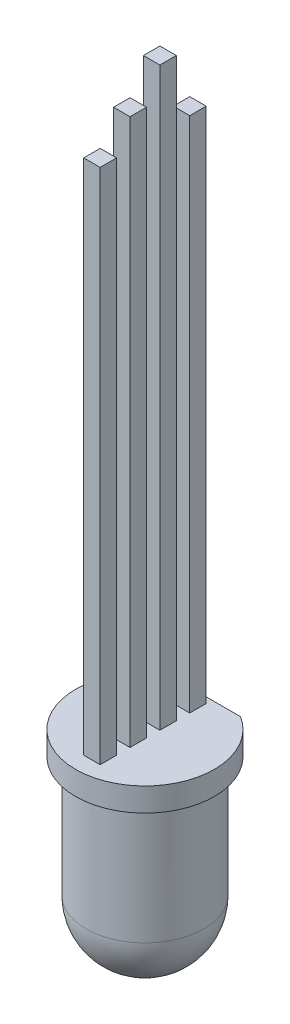
ISO-10303-21;
HEADER;
FILE_DESCRIPTION(('STEP AP214'),'2;1');
FILE_NAME('part.step','',(''),(''),'','','');
FILE_SCHEMA(('AUTOMOTIVE_DESIGN { 1 0 10303 214 1 1 1 1 }'));
ENDSEC;
DATA;
#1=APPLICATION_CONTEXT('core data for automotive mechanical design processes');
#2=APPLICATION_PROTOCOL_DEFINITION('international standard','automotive_design',2000,#1);
#3=PRODUCT_CONTEXT('',#1,'mechanical');
#4=PRODUCT('Part','Part','',(#3));
#5=PRODUCT_RELATED_PRODUCT_CATEGORY('part','',(#4));
#6=PRODUCT_DEFINITION_FORMATION('','',#4);
#7=PRODUCT_DEFINITION_CONTEXT('part definition',#1,'design');
#8=PRODUCT_DEFINITION('design','',#6,#7);
#9=PRODUCT_DEFINITION_SHAPE('','',#8);
#10=(LENGTH_UNIT() NAMED_UNIT(*) SI_UNIT(.MILLI.,.METRE.));
#11=(NAMED_UNIT(*) PLANE_ANGLE_UNIT() SI_UNIT($,.RADIAN.));
#12=(NAMED_UNIT(*) SI_UNIT($,.STERADIAN.) SOLID_ANGLE_UNIT());
#13=UNCERTAINTY_MEASURE_WITH_UNIT(LENGTH_MEASURE(1.E-05),#10,'distance_accuracy_value','');
#14=(GEOMETRIC_REPRESENTATION_CONTEXT(3) GLOBAL_UNCERTAINTY_ASSIGNED_CONTEXT((#13)) GLOBAL_UNIT_ASSIGNED_CONTEXT((#10,
#11,#12)) REPRESENTATION_CONTEXT('',''));
#15=CARTESIAN_POINT('',(0.,0.,0.));
#16=DIRECTION('',(0.,0.,1.));
#17=DIRECTION('',(1.,0.,0.));
#18=AXIS2_PLACEMENT_3D('',#15,#16,#17);
#19=CARTESIAN_POINT('',(2.95000000000001,8.6,0.));
#20=DIRECTION('',(0.,1.,0.));
#21=DIRECTION('',(-1.,0.,0.));
#22=AXIS2_PLACEMENT_3D('',#19,#20,#21);
#23=PLANE('',#22);
#24=DIRECTION('',(1.,0.,0.));
#25=VECTOR('',#24,1.);
#26=CARTESIAN_POINT('',(0.350000000000002,8.6,2.255));
#27=LINE('',#26,#25);
#28=CARTESIAN_POINT('',(-0.349999999999998,8.6,2.255));
#29=VERTEX_POINT('',#28);
#30=CARTESIAN_POINT('',(0.350000000000002,8.6,2.255));
#31=VERTEX_POINT('',#30);
#32=EDGE_CURVE('E261',#29,#31,#27,.T.);
#33=ORIENTED_EDGE('',*,*,#32,.F.);
#34=DIRECTION('',(0.,0.,1.));
#35=VECTOR('',#34,1.);
#36=CARTESIAN_POINT('',(-0.349999999999998,8.6,2.255));
#37=LINE('',#36,#35);
#38=CARTESIAN_POINT('',(-0.349999999999998,8.6,1.555));
#39=VERTEX_POINT('',#38);
#40=EDGE_CURVE('E258',#39,#29,#37,.T.);
#41=ORIENTED_EDGE('',*,*,#40,.F.);
#42=DIRECTION('',(-1.,0.,0.));
#43=VECTOR('',#42,1.);
#44=CARTESIAN_POINT('',(-0.349999999999998,8.6,1.555));
#45=LINE('',#44,#43);
#46=CARTESIAN_POINT('',(0.350000000000017,8.6,1.555));
#47=VERTEX_POINT('',#46);
#48=EDGE_CURVE('E267',#47,#39,#45,.T.);
#49=ORIENTED_EDGE('',*,*,#48,.F.);
#50=DIRECTION('',(0.,0.,-1.));
#51=VECTOR('',#50,1.);
#52=CARTESIAN_POINT('',(0.350000000000002,8.6,1.555));
#53=LINE('',#52,#51);
#54=EDGE_CURVE('E264',#31,#47,#53,.T.);
#55=ORIENTED_EDGE('',*,*,#54,.F.);
#56=EDGE_LOOP('',(#33,#41,#49,#55));
#57=FACE_BOUND('',#56,.T.);
#58=DIRECTION('',(1.,0.,0.));
#59=VECTOR('',#58,1.);
#60=CARTESIAN_POINT('',(0.350000000000002,8.6,-1.555));
#61=LINE('',#60,#59);
#62=CARTESIAN_POINT('',(-0.349999999999998,8.6,-1.555));
#63=VERTEX_POINT('',#62);
#64=CARTESIAN_POINT('',(0.350000000000002,8.6,-1.555));
#65=VERTEX_POINT('',#64);
#66=EDGE_CURVE('E179',#63,#65,#61,.T.);
#67=ORIENTED_EDGE('',*,*,#66,.F.);
#68=DIRECTION('',(0.,0.,1.));
#69=VECTOR('',#68,1.);
#70=CARTESIAN_POINT('',(-0.349999999999998,8.6,-1.555));
#71=LINE('',#70,#69);
#72=CARTESIAN_POINT('',(-0.349999999999998,8.6,-2.255));
#73=VERTEX_POINT('',#72);
#74=EDGE_CURVE('E296',#73,#63,#71,.T.);
#75=ORIENTED_EDGE('',*,*,#74,.F.);
#76=DIRECTION('',(-1.,0.,0.));
#77=VECTOR('',#76,1.);
#78=CARTESIAN_POINT('',(-0.349999999999998,8.6,-2.255));
#79=LINE('',#78,#77);
#80=CARTESIAN_POINT('',(0.350000000000016,8.6,-2.255));
#81=VERTEX_POINT('',#80);
#82=EDGE_CURVE('E302',#81,#73,#79,.T.);
#83=ORIENTED_EDGE('',*,*,#82,.F.);
#84=DIRECTION('',(0.,0.,-1.));
#85=VECTOR('',#84,1.);
#86=CARTESIAN_POINT('',(0.350000000000002,8.6,-2.255));
#87=LINE('',#86,#85);
#88=EDGE_CURVE('E300',#65,#81,#87,.T.);
#89=ORIENTED_EDGE('',*,*,#88,.F.);
#90=EDGE_LOOP('',(#67,#75,#83,#89));
#91=FACE_BOUND('',#90,.T.);
#92=DIRECTION('',(-1.,0.,0.));
#93=VECTOR('',#92,1.);
#94=CARTESIAN_POINT('',(-2.03164321843019,8.6,-2.5));
#95=LINE('',#94,#93);
#96=CARTESIAN_POINT('',(1.56604597633659,8.6,-2.5));
#97=VERTEX_POINT('',#96);
#98=CARTESIAN_POINT('',(-1.56604597633658,8.6,-2.5));
#99=VERTEX_POINT('',#98);
#100=EDGE_CURVE('E197',#97,#99,#95,.T.);
#101=ORIENTED_EDGE('',*,*,#100,.T.);
#102=CARTESIAN_POINT('',(0.,8.6,0.));
#103=DIRECTION('',(0.,-1.,0.));
#104=DIRECTION('',(1.,0.,0.));
#105=AXIS2_PLACEMENT_3D('',#102,#103,#104);
#106=CIRCLE('',#105,2.95);
#107=EDGE_CURVE('E11',#97,#99,#106,.T.);
#108=ORIENTED_EDGE('',*,*,#107,.F.);
#109=EDGE_LOOP('',(#101,#108));
#110=FACE_BOUND('',#109,.T.);
#111=DIRECTION('',(1.,0.,0.));
#112=VECTOR('',#111,1.);
#113=CARTESIAN_POINT('',(-0.349999999999994,8.6,0.985));
#114=LINE('',#113,#112);
#115=CARTESIAN_POINT('',(-0.349999999999994,8.6,0.985));
#116=VERTEX_POINT('',#115);
#117=CARTESIAN_POINT('',(0.350000000000005,8.6,0.985));
#118=VERTEX_POINT('',#117);
#119=EDGE_CURVE('E226',#116,#118,#114,.T.);
#120=ORIENTED_EDGE('',*,*,#119,.F.);
#121=DIRECTION('',(0.,0.,1.));
#122=VECTOR('',#121,1.);
#123=CARTESIAN_POINT('',(-0.349999999999995,8.6,0.285000000000001));
#124=LINE('',#123,#122);
#125=CARTESIAN_POINT('',(-0.349999999999995,8.6,0.285000000000001));
#126=VERTEX_POINT('',#125);
#127=EDGE_CURVE('E278',#126,#116,#124,.T.);
#128=ORIENTED_EDGE('',*,*,#127,.F.);
#129=DIRECTION('',(-1.,0.,0.));
#130=VECTOR('',#129,1.);
#131=CARTESIAN_POINT('',(0.350000000000005,8.6,0.285000000000001));
#132=LINE('',#131,#130);
#133=CARTESIAN_POINT('',(0.35000000000002,8.6,0.285000000000001));
#134=VERTEX_POINT('',#133);
#135=EDGE_CURVE('E285',#134,#126,#132,.T.);
#136=ORIENTED_EDGE('',*,*,#135,.F.);
#137=DIRECTION('',(0.,0.,-1.));
#138=VECTOR('',#137,1.);
#139=CARTESIAN_POINT('',(0.350000000000005,8.6,0.985));
#140=LINE('',#139,#138);
#141=EDGE_CURVE('E282',#118,#134,#140,.T.);
#142=ORIENTED_EDGE('',*,*,#141,.F.);
#143=EDGE_LOOP('',(#120,#128,#136,#142));
#144=FACE_BOUND('',#143,.T.);
#145=DIRECTION('',(1.,0.,0.));
#146=VECTOR('',#145,1.);
#147=CARTESIAN_POINT('',(0.350000000000003,8.6,-0.285000000000001));
#148=LINE('',#147,#146);
#149=CARTESIAN_POINT('',(-0.349999999999998,8.6,-0.285));
#150=VERTEX_POINT('',#149);
#151=CARTESIAN_POINT('',(0.350000000000003,8.6,-0.285000000000001));
#152=VERTEX_POINT('',#151);
#153=EDGE_CURVE('E230',#150,#152,#148,.T.);
#154=ORIENTED_EDGE('',*,*,#153,.F.);
#155=DIRECTION('',(0.,0.,1.));
#156=VECTOR('',#155,1.);
#157=CARTESIAN_POINT('',(-0.349999999999998,8.6,-0.285));
#158=LINE('',#157,#156);
#159=CARTESIAN_POINT('',(-0.349999999999998,8.6,-0.985));
#160=VERTEX_POINT('',#159);
#161=EDGE_CURVE('E233',#160,#150,#158,.T.);
#162=ORIENTED_EDGE('',*,*,#161,.F.);
#163=DIRECTION('',(-1.,0.,0.));
#164=VECTOR('',#163,1.);
#165=CARTESIAN_POINT('',(-0.349999999999998,8.6,-0.985));
#166=LINE('',#165,#164);
#167=CARTESIAN_POINT('',(0.350000000000017,8.6,-0.985));
#168=VERTEX_POINT('',#167);
#169=EDGE_CURVE('E240',#168,#160,#166,.T.);
#170=ORIENTED_EDGE('',*,*,#169,.F.);
#171=DIRECTION('',(0.,0.,-1.));
#172=VECTOR('',#171,1.);
#173=CARTESIAN_POINT('',(0.350000000000002,8.6,-0.985));
#174=LINE('',#173,#172);
#175=EDGE_CURVE('E235',#152,#168,#174,.T.);
#176=ORIENTED_EDGE('',*,*,#175,.F.);
#177=EDGE_LOOP('',(#154,#162,#170,#176));
#178=FACE_BOUND('',#177,.T.);
#179=ADVANCED_FACE('F34',(#57,#91,#110,#144,#178),#23,.T.);
#180=CARTESIAN_POINT('',(0.,2.5,0.));
#181=DIRECTION('',(0.,-1.,0.));
#182=DIRECTION('',(-1.,0.,0.));
#183=AXIS2_PLACEMENT_3D('',#180,#181,#182);
#184=SPHERICAL_SURFACE('',#183,2.5);
#185=CARTESIAN_POINT('',(0.,2.5,0.));
#186=DIRECTION('',(0.,-1.,0.));
#187=DIRECTION('',(1.,0.,0.));
#188=AXIS2_PLACEMENT_3D('',#185,#186,#187);
#189=CIRCLE('',#188,2.50000000000001);
#190=CARTESIAN_POINT('',(2.50000000000001,2.5,0.));
#191=VERTEX_POINT('',#190);
#192=EDGE_CURVE('E200',#191,#191,#189,.T.);
#193=ORIENTED_EDGE('',*,*,#192,.T.);
#194=EDGE_LOOP('',(#193));
#195=FACE_BOUND('',#194,.T.);
#196=ADVANCED_FACE('F36',(#195),#184,.T.);
#197=CARTESIAN_POINT('',(0.,0.,0.));
#198=DIRECTION('',(0.,-1.,0.));
#199=DIRECTION('',(1.,0.,0.));
#200=AXIS2_PLACEMENT_3D('',#197,#198,#199);
#201=CYLINDRICAL_SURFACE('',#200,2.95);
#202=DIRECTION('',(0.,-1.,0.));
#203=VECTOR('',#202,1.);
#204=CARTESIAN_POINT('',(-1.56604597633658,0.,-2.5));
#205=LINE('',#204,#203);
#206=CARTESIAN_POINT('',(-1.56604597633658,7.6,-2.5));
#207=VERTEX_POINT('',#206);
#208=EDGE_CURVE('E191',#99,#207,#205,.T.);
#209=ORIENTED_EDGE('',*,*,#208,.T.);
#210=CARTESIAN_POINT('',(0.,7.6,0.));
#211=DIRECTION('',(0.,-1.,0.));
#212=DIRECTION('',(1.,0.,0.));
#213=AXIS2_PLACEMENT_3D('',#210,#211,#212);
#214=CIRCLE('',#213,2.95);
#215=CARTESIAN_POINT('',(1.56604597633659,7.6,-2.5));
#216=VERTEX_POINT('',#215);
#217=EDGE_CURVE('E42',#216,#207,#214,.T.);
#218=ORIENTED_EDGE('',*,*,#217,.F.);
#219=DIRECTION('',(0.,-1.,0.));
#220=VECTOR('',#219,1.);
#221=CARTESIAN_POINT('',(1.56604597633658,0.,-2.5));
#222=LINE('',#221,#220);
#223=EDGE_CURVE('E183',#216,#97,#222,.F.);
#224=ORIENTED_EDGE('',*,*,#223,.T.);
#225=ORIENTED_EDGE('',*,*,#107,.T.);
#226=EDGE_LOOP('',(#209,#218,#224,#225));
#227=FACE_BOUND('',#226,.T.);
#228=ADVANCED_FACE('F213',(#227),#201,.T.);
#229=CARTESIAN_POINT('',(2.50000000000001,7.6,0.));
#230=DIRECTION('',(0.,-1.,0.));
#231=DIRECTION('',(1.,0.,0.));
#232=AXIS2_PLACEMENT_3D('',#229,#230,#231);
#233=PLANE('',#232);
#234=DIRECTION('',(-1.,0.,0.));
#235=VECTOR('',#234,1.);
#236=CARTESIAN_POINT('',(-2.03164321843019,7.6,-2.5));
#237=LINE('',#236,#235);
#238=CARTESIAN_POINT('',(0.,7.6,-2.5));
#239=VERTEX_POINT('',#238);
#240=EDGE_CURVE('E195',#216,#239,#237,.T.);
#241=ORIENTED_EDGE('',*,*,#240,.F.);
#242=ORIENTED_EDGE('',*,*,#217,.T.);
#243=EDGE_CURVE('E194',#239,#207,#237,.T.);
#244=ORIENTED_EDGE('',*,*,#243,.F.);
#245=CARTESIAN_POINT('',(0.,7.6,0.));
#246=DIRECTION('',(0.,-1.,0.));
#247=DIRECTION('',(1.,0.,0.));
#248=AXIS2_PLACEMENT_3D('',#245,#246,#247);
#249=CIRCLE('',#248,2.5);
#250=EDGE_CURVE('E203',#239,#239,#249,.T.);
#251=ORIENTED_EDGE('',*,*,#250,.F.);
#252=EDGE_LOOP('',(#241,#242,#244,#251));
#253=FACE_BOUND('',#252,.T.);
#254=ADVANCED_FACE('F210',(#253),#233,.T.);
#255=CARTESIAN_POINT('',(0.,0.,0.));
#256=DIRECTION('',(0.,-1.,0.));
#257=DIRECTION('',(1.,0.,0.));
#258=AXIS2_PLACEMENT_3D('',#255,#256,#257);
#259=CYLINDRICAL_SURFACE('',#258,2.5);
#260=ORIENTED_EDGE('',*,*,#250,.T.);
#261=EDGE_LOOP('',(#260));
#262=FACE_BOUND('',#261,.T.);
#263=ORIENTED_EDGE('',*,*,#192,.F.);
#264=EDGE_LOOP('',(#263));
#265=FACE_BOUND('',#264,.T.);
#266=ADVANCED_FACE('F403',(#262,#265),#259,.T.);
#267=CARTESIAN_POINT('',(-2.03164321843019,8.601,-2.5));
#268=DIRECTION('',(0.,0.,1.));
#269=DIRECTION('',(1.,0.,0.));
#270=AXIS2_PLACEMENT_3D('',#267,#268,#269);
#271=PLANE('',#270);
#272=ORIENTED_EDGE('',*,*,#100,.F.);
#273=ORIENTED_EDGE('',*,*,#223,.F.);
#274=ORIENTED_EDGE('',*,*,#240,.T.);
#275=ORIENTED_EDGE('',*,*,#243,.T.);
#276=ORIENTED_EDGE('',*,*,#208,.F.);
#277=EDGE_LOOP('',(#272,#273,#274,#275,#276));
#278=FACE_BOUND('',#277,.T.);
#279=ADVANCED_FACE('F216',(#278),#271,.F.);
#280=CARTESIAN_POINT('',(-0.349999999999984,33.1,-1.555));
#281=DIRECTION('',(1.,0.,0.));
#282=DIRECTION('',(0.,1.,0.));
#283=AXIS2_PLACEMENT_3D('',#280,#281,#282);
#284=PLANE('',#283);
#285=DIRECTION('',(0.,-1.,0.));
#286=VECTOR('',#285,1.);
#287=CARTESIAN_POINT('',(-0.349999999999984,33.1,-1.555));
#288=LINE('',#287,#286);
#289=CARTESIAN_POINT('',(-0.349999999999985,30.6,-1.555));
#290=VERTEX_POINT('',#289);
#291=EDGE_CURVE('E181',#290,#63,#288,.T.);
#292=ORIENTED_EDGE('',*,*,#291,.F.);
#293=DIRECTION('',(0.,0.,1.));
#294=VECTOR('',#293,1.);
#295=CARTESIAN_POINT('',(-0.349999999999985,30.6,-2.8850955673576));
#296=LINE('',#295,#294);
#297=CARTESIAN_POINT('',(-0.349999999999985,30.6,-2.255));
#298=VERTEX_POINT('',#297);
#299=EDGE_CURVE('E163',#298,#290,#296,.T.);
#300=ORIENTED_EDGE('',*,*,#299,.F.);
#301=DIRECTION('',(0.,-1.,0.));
#302=VECTOR('',#301,1.);
#303=CARTESIAN_POINT('',(-0.349999999999984,33.1,-2.255));
#304=LINE('',#303,#302);
#305=EDGE_CURVE('E185',#298,#73,#304,.T.);
#306=ORIENTED_EDGE('',*,*,#305,.T.);
#307=ORIENTED_EDGE('',*,*,#74,.T.);
#308=EDGE_LOOP('',(#292,#300,#306,#307));
#309=FACE_BOUND('',#308,.T.);
#310=ADVANCED_FACE('F306',(#309),#284,.F.);
#311=CARTESIAN_POINT('',(0.350000000000016,33.1,-1.555));
#312=DIRECTION('',(0.,0.,-1.));
#313=DIRECTION('',(-1.,0.,0.));
#314=AXIS2_PLACEMENT_3D('',#311,#312,#313);
#315=PLANE('',#314);
#316=DIRECTION('',(0.,-1.,0.));
#317=VECTOR('',#316,1.);
#318=CARTESIAN_POINT('',(0.350000000000016,33.1,-1.555));
#319=LINE('',#318,#317);
#320=CARTESIAN_POINT('',(0.350000000000015,30.6,-1.555));
#321=VERTEX_POINT('',#320);
#322=EDGE_CURVE('E172',#321,#65,#319,.T.);
#323=ORIENTED_EDGE('',*,*,#322,.F.);
#324=DIRECTION('',(1.,0.,0.));
#325=VECTOR('',#324,1.);
#326=CARTESIAN_POINT('',(2.95100000000003,30.6,-1.555));
#327=LINE('',#326,#325);
#328=EDGE_CURVE('E160',#290,#321,#327,.T.);
#329=ORIENTED_EDGE('',*,*,#328,.F.);
#330=ORIENTED_EDGE('',*,*,#291,.T.);
#331=ORIENTED_EDGE('',*,*,#66,.T.);
#332=EDGE_LOOP('',(#323,#329,#330,#331));
#333=FACE_BOUND('',#332,.T.);
#334=ADVANCED_FACE('F177',(#333),#315,.F.);
#335=CARTESIAN_POINT('',(0.350000000000016,33.1,-2.255));
#336=DIRECTION('',(-1.,0.,0.));
#337=DIRECTION('',(0.,-1.,0.));
#338=AXIS2_PLACEMENT_3D('',#335,#336,#337);
#339=PLANE('',#338);
#340=DIRECTION('',(0.,-1.,0.));
#341=VECTOR('',#340,1.);
#342=CARTESIAN_POINT('',(0.350000000000016,33.1,-2.255));
#343=LINE('',#342,#341);
#344=CARTESIAN_POINT('',(0.350000000000015,30.6,-2.255));
#345=VERTEX_POINT('',#344);
#346=EDGE_CURVE('E174',#345,#81,#343,.T.);
#347=ORIENTED_EDGE('',*,*,#346,.F.);
#348=DIRECTION('',(0.,0.,-1.));
#349=VECTOR('',#348,1.);
#350=CARTESIAN_POINT('',(0.350000000000015,30.6,-2.8850955673576));
#351=LINE('',#350,#349);
#352=EDGE_CURVE('E49',#321,#345,#351,.T.);
#353=ORIENTED_EDGE('',*,*,#352,.F.);
#354=ORIENTED_EDGE('',*,*,#322,.T.);
#355=ORIENTED_EDGE('',*,*,#88,.T.);
#356=EDGE_LOOP('',(#347,#353,#354,#355));
#357=FACE_BOUND('',#356,.T.);
#358=ADVANCED_FACE('F170',(#357),#339,.F.);
#359=CARTESIAN_POINT('',(-0.349999999999984,33.1,-2.255));
#360=DIRECTION('',(0.,0.,1.));
#361=DIRECTION('',(1.,0.,0.));
#362=AXIS2_PLACEMENT_3D('',#359,#360,#361);
#363=PLANE('',#362);
#364=ORIENTED_EDGE('',*,*,#305,.F.);
#365=DIRECTION('',(-1.,0.,0.));
#366=VECTOR('',#365,1.);
#367=CARTESIAN_POINT('',(2.95100000000003,30.6,-2.255));
#368=LINE('',#367,#366);
#369=EDGE_CURVE('E175',#345,#298,#368,.T.);
#370=ORIENTED_EDGE('',*,*,#369,.F.);
#371=ORIENTED_EDGE('',*,*,#346,.T.);
#372=ORIENTED_EDGE('',*,*,#82,.T.);
#373=EDGE_LOOP('',(#364,#370,#371,#372));
#374=FACE_BOUND('',#373,.T.);
#375=ADVANCED_FACE('F310',(#374),#363,.F.);
#376=CARTESIAN_POINT('',(-0.34999999999998,33.1,0.285000000000001));
#377=DIRECTION('',(1.,0.,0.));
#378=DIRECTION('',(0.,1.,0.));
#379=AXIS2_PLACEMENT_3D('',#376,#377,#378);
#380=PLANE('',#379);
#381=DIRECTION('',(0.,-1.,0.));
#382=VECTOR('',#381,1.);
#383=CARTESIAN_POINT('',(-0.34999999999998,33.1,0.985));
#384=LINE('',#383,#382);
#385=CARTESIAN_POINT('',(-0.349999999999981,31.83,0.985));
#386=VERTEX_POINT('',#385);
#387=EDGE_CURVE('E294',#386,#116,#384,.T.);
#388=ORIENTED_EDGE('',*,*,#387,.F.);
#389=DIRECTION('',(0.,0.,1.));
#390=VECTOR('',#389,1.);
#391=CARTESIAN_POINT('',(-0.349999999999984,31.83,0.));
#392=LINE('',#391,#390);
#393=CARTESIAN_POINT('',(-0.349999999999981,31.83,0.285000000000001));
#394=VERTEX_POINT('',#393);
#395=EDGE_CURVE('E326',#394,#386,#392,.T.);
#396=ORIENTED_EDGE('',*,*,#395,.F.);
#397=DIRECTION('',(0.,-1.,0.));
#398=VECTOR('',#397,1.);
#399=CARTESIAN_POINT('',(-0.34999999999998,33.1,0.285000000000001));
#400=LINE('',#399,#398);
#401=EDGE_CURVE('E288',#394,#126,#400,.T.);
#402=ORIENTED_EDGE('',*,*,#401,.T.);
#403=ORIENTED_EDGE('',*,*,#127,.T.);
#404=EDGE_LOOP('',(#388,#396,#402,#403));
#405=FACE_BOUND('',#404,.T.);
#406=ADVANCED_FACE('F388',(#405),#380,.F.);
#407=CARTESIAN_POINT('',(-0.34999999999998,33.1,0.985));
#408=DIRECTION('',(0.,0.,-1.));
#409=DIRECTION('',(-1.,0.,0.));
#410=AXIS2_PLACEMENT_3D('',#407,#408,#409);
#411=PLANE('',#410);
#412=DIRECTION('',(0.,-1.,0.));
#413=VECTOR('',#412,1.);
#414=CARTESIAN_POINT('',(0.35000000000002,33.1,0.985));
#415=LINE('',#414,#413);
#416=CARTESIAN_POINT('',(0.350000000000019,31.83,0.985));
#417=VERTEX_POINT('',#416);
#418=EDGE_CURVE('E292',#417,#118,#415,.T.);
#419=ORIENTED_EDGE('',*,*,#418,.F.);
#420=DIRECTION('',(1.,0.,0.));
#421=VECTOR('',#420,1.);
#422=CARTESIAN_POINT('',(2.95100000000003,31.83,0.985));
#423=LINE('',#422,#421);
#424=EDGE_CURVE('E324',#386,#417,#423,.T.);
#425=ORIENTED_EDGE('',*,*,#424,.F.);
#426=ORIENTED_EDGE('',*,*,#387,.T.);
#427=ORIENTED_EDGE('',*,*,#119,.T.);
#428=EDGE_LOOP('',(#419,#425,#426,#427));
#429=FACE_BOUND('',#428,.T.);
#430=ADVANCED_FACE('F384',(#429),#411,.F.);
#431=CARTESIAN_POINT('',(0.35000000000002,33.1,0.985));
#432=DIRECTION('',(-1.,0.,0.));
#433=DIRECTION('',(0.,-1.,0.));
#434=AXIS2_PLACEMENT_3D('',#431,#432,#433);
#435=PLANE('',#434);
#436=DIRECTION('',(0.,-1.,0.));
#437=VECTOR('',#436,1.);
#438=CARTESIAN_POINT('',(0.35000000000002,33.1,0.285000000000001));
#439=LINE('',#438,#437);
#440=CARTESIAN_POINT('',(0.350000000000019,31.83,0.285000000000001));
#441=VERTEX_POINT('',#440);
#442=EDGE_CURVE('E290',#441,#134,#439,.T.);
#443=ORIENTED_EDGE('',*,*,#442,.F.);
#444=DIRECTION('',(0.,0.,-1.));
#445=VECTOR('',#444,1.);
#446=CARTESIAN_POINT('',(0.350000000000019,31.83,0.));
#447=LINE('',#446,#445);
#448=EDGE_CURVE('E242',#417,#441,#447,.T.);
#449=ORIENTED_EDGE('',*,*,#448,.F.);
#450=ORIENTED_EDGE('',*,*,#418,.T.);
#451=ORIENTED_EDGE('',*,*,#141,.T.);
#452=EDGE_LOOP('',(#443,#449,#450,#451));
#453=FACE_BOUND('',#452,.T.);
#454=ADVANCED_FACE('F380',(#453),#435,.F.);
#455=CARTESIAN_POINT('',(0.35000000000002,33.1,0.285000000000001));
#456=DIRECTION('',(0.,0.,1.));
#457=DIRECTION('',(1.,0.,0.));
#458=AXIS2_PLACEMENT_3D('',#455,#456,#457);
#459=PLANE('',#458);
#460=ORIENTED_EDGE('',*,*,#401,.F.);
#461=DIRECTION('',(-1.,0.,0.));
#462=VECTOR('',#461,1.);
#463=CARTESIAN_POINT('',(2.95100000000003,31.83,0.285000000000001));
#464=LINE('',#463,#462);
#465=EDGE_CURVE('E320',#441,#394,#464,.T.);
#466=ORIENTED_EDGE('',*,*,#465,.F.);
#467=ORIENTED_EDGE('',*,*,#442,.T.);
#468=ORIENTED_EDGE('',*,*,#135,.T.);
#469=EDGE_LOOP('',(#460,#466,#467,#468));
#470=FACE_BOUND('',#469,.T.);
#471=ADVANCED_FACE('F376',(#470),#459,.F.);
#472=CARTESIAN_POINT('',(-0.349999999999983,33.1,2.255));
#473=DIRECTION('',(1.,0.,0.));
#474=DIRECTION('',(0.,1.,0.));
#475=AXIS2_PLACEMENT_3D('',#472,#473,#474);
#476=PLANE('',#475);
#477=DIRECTION('',(0.,-1.,0.));
#478=VECTOR('',#477,1.);
#479=CARTESIAN_POINT('',(-0.349999999999983,33.1,2.255));
#480=LINE('',#479,#478);
#481=CARTESIAN_POINT('',(-0.349999999999985,30.6,2.255));
#482=VERTEX_POINT('',#481);
#483=EDGE_CURVE('E276',#482,#29,#480,.T.);
#484=ORIENTED_EDGE('',*,*,#483,.F.);
#485=DIRECTION('',(0.,0.,1.));
#486=VECTOR('',#485,1.);
#487=CARTESIAN_POINT('',(-0.349999999999985,30.6,1.34441299144352));
#488=LINE('',#487,#486);
#489=CARTESIAN_POINT('',(-0.349999999999985,30.6,1.555));
#490=VERTEX_POINT('',#489);
#491=EDGE_CURVE('E317',#490,#482,#488,.T.);
#492=ORIENTED_EDGE('',*,*,#491,.F.);
#493=DIRECTION('',(0.,-1.,0.));
#494=VECTOR('',#493,1.);
#495=CARTESIAN_POINT('',(-0.349999999999983,33.1,1.555));
#496=LINE('',#495,#494);
#497=EDGE_CURVE('E270',#490,#39,#496,.T.);
#498=ORIENTED_EDGE('',*,*,#497,.T.);
#499=ORIENTED_EDGE('',*,*,#40,.T.);
#500=EDGE_LOOP('',(#484,#492,#498,#499));
#501=FACE_BOUND('',#500,.T.);
#502=ADVANCED_FACE('F372',(#501),#476,.F.);
#503=CARTESIAN_POINT('',(0.350000000000017,33.1,2.255));
#504=DIRECTION('',(0.,0.,-1.));
#505=DIRECTION('',(-1.,0.,0.));
#506=AXIS2_PLACEMENT_3D('',#503,#504,#505);
#507=PLANE('',#506);
#508=DIRECTION('',(0.,-1.,0.));
#509=VECTOR('',#508,1.);
#510=CARTESIAN_POINT('',(0.350000000000017,33.1,2.255));
#511=LINE('',#510,#509);
#512=CARTESIAN_POINT('',(0.350000000000015,30.6,2.255));
#513=VERTEX_POINT('',#512);
#514=EDGE_CURVE('E274',#513,#31,#511,.T.);
#515=ORIENTED_EDGE('',*,*,#514,.F.);
#516=DIRECTION('',(1.,0.,0.));
#517=VECTOR('',#516,1.);
#518=CARTESIAN_POINT('',(2.95100000000003,30.6,2.255));
#519=LINE('',#518,#517);
#520=EDGE_CURVE('E318',#482,#513,#519,.T.);
#521=ORIENTED_EDGE('',*,*,#520,.F.);
#522=ORIENTED_EDGE('',*,*,#483,.T.);
#523=ORIENTED_EDGE('',*,*,#32,.T.);
#524=EDGE_LOOP('',(#515,#521,#522,#523));
#525=FACE_BOUND('',#524,.T.);
#526=ADVANCED_FACE('F368',(#525),#507,.F.);
#527=CARTESIAN_POINT('',(0.350000000000017,33.1,1.555));
#528=DIRECTION('',(-1.,0.,0.));
#529=DIRECTION('',(0.,-1.,0.));
#530=AXIS2_PLACEMENT_3D('',#527,#528,#529);
#531=PLANE('',#530);
#532=DIRECTION('',(0.,-1.,0.));
#533=VECTOR('',#532,1.);
#534=CARTESIAN_POINT('',(0.350000000000017,33.1,1.555));
#535=LINE('',#534,#533);
#536=CARTESIAN_POINT('',(0.350000000000015,30.6,1.555));
#537=VERTEX_POINT('',#536);
#538=EDGE_CURVE('E272',#537,#47,#535,.T.);
#539=ORIENTED_EDGE('',*,*,#538,.F.);
#540=DIRECTION('',(0.,0.,-1.));
#541=VECTOR('',#540,1.);
#542=CARTESIAN_POINT('',(0.350000000000015,30.6,1.34441299144352));
#543=LINE('',#542,#541);
#544=EDGE_CURVE('E57',#513,#537,#543,.T.);
#545=ORIENTED_EDGE('',*,*,#544,.F.);
#546=ORIENTED_EDGE('',*,*,#514,.T.);
#547=ORIENTED_EDGE('',*,*,#54,.T.);
#548=EDGE_LOOP('',(#539,#545,#546,#547));
#549=FACE_BOUND('',#548,.T.);
#550=ADVANCED_FACE('F364',(#549),#531,.F.);
#551=CARTESIAN_POINT('',(-0.349999999999983,33.1,1.555));
#552=DIRECTION('',(0.,0.,1.));
#553=DIRECTION('',(1.,0.,0.));
#554=AXIS2_PLACEMENT_3D('',#551,#552,#553);
#555=PLANE('',#554);
#556=ORIENTED_EDGE('',*,*,#497,.F.);
#557=DIRECTION('',(-1.,0.,0.));
#558=VECTOR('',#557,1.);
#559=CARTESIAN_POINT('',(2.95100000000003,30.6,1.555));
#560=LINE('',#559,#558);
#561=EDGE_CURVE('E313',#537,#490,#560,.T.);
#562=ORIENTED_EDGE('',*,*,#561,.F.);
#563=ORIENTED_EDGE('',*,*,#538,.T.);
#564=ORIENTED_EDGE('',*,*,#48,.T.);
#565=EDGE_LOOP('',(#556,#562,#563,#564));
#566=FACE_BOUND('',#565,.T.);
#567=ADVANCED_FACE('F361',(#566),#555,.F.);
#568=CARTESIAN_POINT('',(-0.349999999999983,33.1,-0.285));
#569=DIRECTION('',(1.,0.,0.));
#570=DIRECTION('',(0.,1.,0.));
#571=AXIS2_PLACEMENT_3D('',#568,#569,#570);
#572=PLANE('',#571);
#573=ORIENTED_EDGE('',*,*,#161,.T.);
#574=DIRECTION('',(0.,-1.,0.));
#575=VECTOR('',#574,1.);
#576=CARTESIAN_POINT('',(-0.349999999999983,33.1,-0.285));
#577=LINE('',#576,#575);
#578=CARTESIAN_POINT('',(-0.349999999999983,33.1,-0.285));
#579=VERTEX_POINT('',#578);
#580=EDGE_CURVE('E256',#579,#150,#577,.T.);
#581=ORIENTED_EDGE('',*,*,#580,.F.);
#582=DIRECTION('',(0.,0.,1.));
#583=VECTOR('',#582,1.);
#584=CARTESIAN_POINT('',(-0.349999999999983,33.1,-0.285));
#585=LINE('',#584,#583);
#586=CARTESIAN_POINT('',(-0.349999999999983,33.1,-0.985));
#587=VERTEX_POINT('',#586);
#588=EDGE_CURVE('E247',#587,#579,#585,.T.);
#589=ORIENTED_EDGE('',*,*,#588,.F.);
#590=DIRECTION('',(0.,-1.,0.));
#591=VECTOR('',#590,1.);
#592=CARTESIAN_POINT('',(-0.349999999999983,33.1,-0.985));
#593=LINE('',#592,#591);
#594=EDGE_CURVE('E248',#587,#160,#593,.T.);
#595=ORIENTED_EDGE('',*,*,#594,.T.);
#596=EDGE_LOOP('',(#573,#581,#589,#595));
#597=FACE_BOUND('',#596,.T.);
#598=ADVANCED_FACE('F345',(#597),#572,.F.);
#599=CARTESIAN_POINT('',(0.350000000000017,33.1,-0.285000000000001));
#600=DIRECTION('',(0.,0.,-1.));
#601=DIRECTION('',(-1.,0.,0.));
#602=AXIS2_PLACEMENT_3D('',#599,#600,#601);
#603=PLANE('',#602);
#604=ORIENTED_EDGE('',*,*,#153,.T.);
#605=DIRECTION('',(0.,-1.,0.));
#606=VECTOR('',#605,1.);
#607=CARTESIAN_POINT('',(0.350000000000017,33.1,-0.285000000000001));
#608=LINE('',#607,#606);
#609=CARTESIAN_POINT('',(0.350000000000017,33.1,-0.285000000000001));
#610=VERTEX_POINT('',#609);
#611=EDGE_CURVE('E254',#610,#152,#608,.T.);
#612=ORIENTED_EDGE('',*,*,#611,.F.);
#613=DIRECTION('',(1.,0.,0.));
#614=VECTOR('',#613,1.);
#615=CARTESIAN_POINT('',(0.350000000000017,33.1,-0.285000000000001));
#616=LINE('',#615,#614);
#617=EDGE_CURVE('E331',#579,#610,#616,.T.);
#618=ORIENTED_EDGE('',*,*,#617,.F.);
#619=ORIENTED_EDGE('',*,*,#580,.T.);
#620=EDGE_LOOP('',(#604,#612,#618,#619));
#621=FACE_BOUND('',#620,.T.);
#622=ADVANCED_FACE('F346',(#621),#603,.F.);
#623=CARTESIAN_POINT('',(0.350000000000017,33.1,-0.985));
#624=DIRECTION('',(-1.,0.,0.));
#625=DIRECTION('',(0.,-1.,0.));
#626=AXIS2_PLACEMENT_3D('',#623,#624,#625);
#627=PLANE('',#626);
#628=ORIENTED_EDGE('',*,*,#175,.T.);
#629=DIRECTION('',(0.,-1.,0.));
#630=VECTOR('',#629,1.);
#631=CARTESIAN_POINT('',(0.350000000000017,33.1,-0.985));
#632=LINE('',#631,#630);
#633=CARTESIAN_POINT('',(0.350000000000017,33.1,-0.985));
#634=VERTEX_POINT('',#633);
#635=EDGE_CURVE('E251',#634,#168,#632,.T.);
#636=ORIENTED_EDGE('',*,*,#635,.F.);
#637=DIRECTION('',(0.,0.,-1.));
#638=VECTOR('',#637,1.);
#639=CARTESIAN_POINT('',(0.350000000000017,33.1,-0.985));
#640=LINE('',#639,#638);
#641=EDGE_CURVE('E333',#610,#634,#640,.T.);
#642=ORIENTED_EDGE('',*,*,#641,.F.);
#643=ORIENTED_EDGE('',*,*,#611,.T.);
#644=EDGE_LOOP('',(#628,#636,#642,#643));
#645=FACE_BOUND('',#644,.T.);
#646=ADVANCED_FACE('F348',(#645),#627,.F.);
#647=CARTESIAN_POINT('',(-0.349999999999983,33.1,-0.985));
#648=DIRECTION('',(0.,0.,1.));
#649=DIRECTION('',(1.,0.,0.));
#650=AXIS2_PLACEMENT_3D('',#647,#648,#649);
#651=PLANE('',#650);
#652=ORIENTED_EDGE('',*,*,#169,.T.);
#653=ORIENTED_EDGE('',*,*,#594,.F.);
#654=DIRECTION('',(-1.,0.,0.));
#655=VECTOR('',#654,1.);
#656=CARTESIAN_POINT('',(-0.349999999999983,33.1,-0.985));
#657=LINE('',#656,#655);
#658=EDGE_CURVE('E252',#634,#587,#657,.T.);
#659=ORIENTED_EDGE('',*,*,#658,.F.);
#660=ORIENTED_EDGE('',*,*,#635,.T.);
#661=EDGE_LOOP('',(#652,#653,#659,#660));
#662=FACE_BOUND('',#661,.T.);
#663=ADVANCED_FACE('F343',(#662),#651,.F.);
#664=CARTESIAN_POINT('',(0.,33.1,0.));
#665=DIRECTION('',(0.,-1.,0.));
#666=DIRECTION('',(0.,0.,-1.));
#667=AXIS2_PLACEMENT_3D('',#664,#665,#666);
#668=PLANE('',#667);
#669=ORIENTED_EDGE('',*,*,#588,.T.);
#670=ORIENTED_EDGE('',*,*,#617,.T.);
#671=ORIENTED_EDGE('',*,*,#641,.T.);
#672=ORIENTED_EDGE('',*,*,#658,.T.);
#673=EDGE_LOOP('',(#669,#670,#671,#672));
#674=FACE_BOUND('',#673,.T.);
#675=ADVANCED_FACE('F337',(#674),#668,.F.);
#676=CARTESIAN_POINT('',(2.95100000000003,31.83,0.));
#677=DIRECTION('',(0.,-1.,0.));
#678=DIRECTION('',(1.,0.,0.));
#679=AXIS2_PLACEMENT_3D('',#676,#677,#678);
#680=PLANE('',#679);
#681=ORIENTED_EDGE('',*,*,#424,.T.);
#682=ORIENTED_EDGE('',*,*,#448,.T.);
#683=ORIENTED_EDGE('',*,*,#465,.T.);
#684=ORIENTED_EDGE('',*,*,#395,.T.);
#685=EDGE_LOOP('',(#681,#682,#683,#684));
#686=FACE_BOUND('',#685,.T.);
#687=ADVANCED_FACE('F460',(#686),#680,.F.);
#688=CARTESIAN_POINT('',(2.95100000000003,30.6,1.34441299144352));
#689=DIRECTION('',(0.,-1.,0.));
#690=DIRECTION('',(1.,0.,0.));
#691=AXIS2_PLACEMENT_3D('',#688,#689,#690);
#692=PLANE('',#691);
#693=ORIENTED_EDGE('',*,*,#520,.T.);
#694=ORIENTED_EDGE('',*,*,#544,.T.);
#695=ORIENTED_EDGE('',*,*,#561,.T.);
#696=ORIENTED_EDGE('',*,*,#491,.T.);
#697=EDGE_LOOP('',(#693,#694,#695,#696));
#698=FACE_BOUND('',#697,.T.);
#699=ADVANCED_FACE('F539',(#698),#692,.F.);
#700=CARTESIAN_POINT('',(2.95100000000003,30.6,-2.8850955673576));
#701=DIRECTION('',(0.,-1.,0.));
#702=DIRECTION('',(1.,0.,0.));
#703=AXIS2_PLACEMENT_3D('',#700,#701,#702);
#704=PLANE('',#703);
#705=ORIENTED_EDGE('',*,*,#328,.T.);
#706=ORIENTED_EDGE('',*,*,#352,.T.);
#707=ORIENTED_EDGE('',*,*,#369,.T.);
#708=ORIENTED_EDGE('',*,*,#299,.T.);
#709=EDGE_LOOP('',(#705,#706,#707,#708));
#710=FACE_BOUND('',#709,.T.);
#711=ADVANCED_FACE('F161',(#710),#704,.F.);
#712=CLOSED_SHELL('',(#179,#196,#228,#254,#266,#279,#310,#334,#358,#375,#406,#430,#454,#471,
#502,#526,#550,#567,#598,#622,#646,#663,#675,#687,#699,#711));
#713=MANIFOLD_SOLID_BREP('B2',#712);
#714=ADVANCED_BREP_SHAPE_REPRESENTATION('',(#18,#713),#14);
#715=SHAPE_DEFINITION_REPRESENTATION(#9,#714);
ENDSEC;
END-ISO-10303-21;
